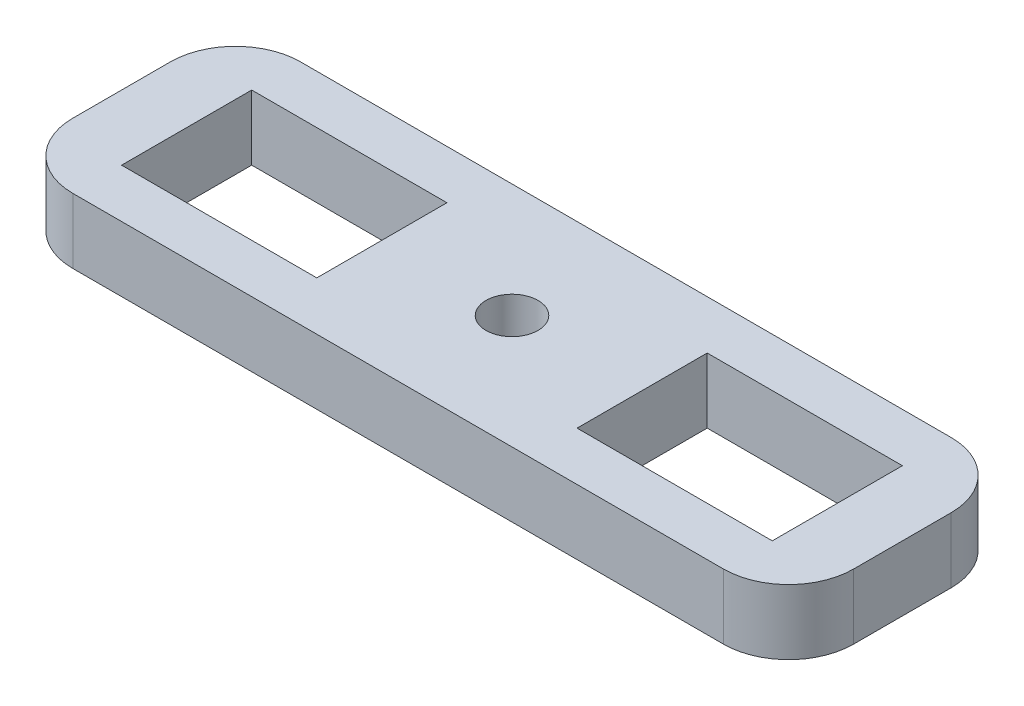
ISO-10303-21;
HEADER;
FILE_DESCRIPTION(('STEP AP214'),'2;1');
FILE_NAME('part.step','',(''),(''),'','','');
FILE_SCHEMA(('AUTOMOTIVE_DESIGN { 1 0 10303 214 1 1 1 1 }'));
ENDSEC;
DATA;
#1=APPLICATION_CONTEXT('core data for automotive mechanical design processes');
#2=APPLICATION_PROTOCOL_DEFINITION('international standard','automotive_design',2000,#1);
#3=PRODUCT_CONTEXT('',#1,'mechanical');
#4=PRODUCT('Part','Part','',(#3));
#5=PRODUCT_RELATED_PRODUCT_CATEGORY('part','',(#4));
#6=PRODUCT_DEFINITION_FORMATION('','',#4);
#7=PRODUCT_DEFINITION_CONTEXT('part definition',#1,'design');
#8=PRODUCT_DEFINITION('design','',#6,#7);
#9=PRODUCT_DEFINITION_SHAPE('','',#8);
#10=(LENGTH_UNIT() NAMED_UNIT(*) SI_UNIT(.MILLI.,.METRE.));
#11=(NAMED_UNIT(*) PLANE_ANGLE_UNIT() SI_UNIT($,.RADIAN.));
#12=(NAMED_UNIT(*) SI_UNIT($,.STERADIAN.) SOLID_ANGLE_UNIT());
#13=UNCERTAINTY_MEASURE_WITH_UNIT(LENGTH_MEASURE(1.E-05),#10,'distance_accuracy_value','');
#14=(GEOMETRIC_REPRESENTATION_CONTEXT(3) GLOBAL_UNCERTAINTY_ASSIGNED_CONTEXT((#13)) GLOBAL_UNIT_ASSIGNED_CONTEXT((#10,
#11,#12)) REPRESENTATION_CONTEXT('',''));
#15=CARTESIAN_POINT('',(0.,0.,0.));
#16=DIRECTION('',(0.,0.,1.));
#17=DIRECTION('',(1.,0.,0.));
#18=AXIS2_PLACEMENT_3D('',#15,#16,#17);
#19=CARTESIAN_POINT('',(10.,10.,-10.));
#20=DIRECTION('',(0.,-1.,0.));
#21=DIRECTION('',(0.,0.,-1.));
#22=AXIS2_PLACEMENT_3D('',#19,#20,#21);
#23=PLANE('',#22);
#24=DIRECTION('',(-1.,0.,0.));
#25=VECTOR('',#24,1.);
#26=CARTESIAN_POINT('',(110.,10.,-27.5));
#27=LINE('',#26,#25);
#28=CARTESIAN_POINT('',(110.,10.,-27.5));
#29=VERTEX_POINT('',#28);
#30=CARTESIAN_POINT('',(80.,10.,-27.5));
#31=VERTEX_POINT('',#30);
#32=EDGE_CURVE('E143',#29,#31,#27,.T.);
#33=ORIENTED_EDGE('',*,*,#32,.F.);
#34=DIRECTION('',(0.,0.,-1.));
#35=VECTOR('',#34,1.);
#36=CARTESIAN_POINT('',(110.,10.,-27.5));
#37=LINE('',#36,#35);
#38=CARTESIAN_POINT('',(110.,10.,-7.5));
#39=VERTEX_POINT('',#38);
#40=EDGE_CURVE('E166',#39,#29,#37,.T.);
#41=ORIENTED_EDGE('',*,*,#40,.F.);
#42=DIRECTION('',(1.,0.,0.));
#43=VECTOR('',#42,1.);
#44=CARTESIAN_POINT('',(110.,10.,-7.5));
#45=LINE('',#44,#43);
#46=CARTESIAN_POINT('',(80.,10.,-7.5));
#47=VERTEX_POINT('',#46);
#48=EDGE_CURVE('E164',#47,#39,#45,.T.);
#49=ORIENTED_EDGE('',*,*,#48,.F.);
#50=DIRECTION('',(0.,0.,1.));
#51=VECTOR('',#50,1.);
#52=CARTESIAN_POINT('',(80.,10.,-27.5));
#53=LINE('',#52,#51);
#54=EDGE_CURVE('E151',#31,#47,#53,.T.);
#55=ORIENTED_EDGE('',*,*,#54,.F.);
#56=EDGE_LOOP('',(#33,#41,#49,#55));
#57=FACE_BOUND('',#56,.T.);
#58=CARTESIAN_POINT('',(10.,10.,-10.));
#59=DIRECTION('',(0.,1.,0.));
#60=DIRECTION('',(0.,0.,-1.));
#61=AXIS2_PLACEMENT_3D('',#58,#59,#60);
#62=CIRCLE('',#61,10.);
#63=CARTESIAN_POINT('',(0.,10.,-10.0000000000001));
#64=VERTEX_POINT('',#63);
#65=CARTESIAN_POINT('',(10.0000000000001,10.,0.));
#66=VERTEX_POINT('',#65);
#67=EDGE_CURVE('E213',#64,#66,#62,.T.);
#68=ORIENTED_EDGE('',*,*,#67,.T.);
#69=DIRECTION('',(1.,0.,0.));
#70=VECTOR('',#69,1.);
#71=CARTESIAN_POINT('',(10.0000000000001,10.,0.));
#72=LINE('',#71,#70);
#73=CARTESIAN_POINT('',(110.,10.,0.));
#74=VERTEX_POINT('',#73);
#75=EDGE_CURVE('E216',#66,#74,#72,.T.);
#76=ORIENTED_EDGE('',*,*,#75,.T.);
#77=CARTESIAN_POINT('',(110.,10.,-10.));
#78=DIRECTION('',(0.,1.,0.));
#79=DIRECTION('',(0.,0.,1.));
#80=AXIS2_PLACEMENT_3D('',#77,#78,#79);
#81=CIRCLE('',#80,10.);
#82=CARTESIAN_POINT('',(120.,10.,-10.0000000000001));
#83=VERTEX_POINT('',#82);
#84=EDGE_CURVE('E219',#74,#83,#81,.T.);
#85=ORIENTED_EDGE('',*,*,#84,.T.);
#86=DIRECTION('',(0.,0.,-1.));
#87=VECTOR('',#86,1.);
#88=CARTESIAN_POINT('',(120.,10.,-10.0000000000001));
#89=LINE('',#88,#87);
#90=CARTESIAN_POINT('',(120.,10.,-24.9999999999999));
#91=VERTEX_POINT('',#90);
#92=EDGE_CURVE('E221',#83,#91,#89,.T.);
#93=ORIENTED_EDGE('',*,*,#92,.T.);
#94=CARTESIAN_POINT('',(110.,10.,-25.));
#95=DIRECTION('',(0.,1.,0.));
#96=DIRECTION('',(0.,0.,-1.));
#97=AXIS2_PLACEMENT_3D('',#94,#95,#96);
#98=CIRCLE('',#97,10.);
#99=CARTESIAN_POINT('',(110.,10.,-35.));
#100=VERTEX_POINT('',#99);
#101=EDGE_CURVE('E223',#91,#100,#98,.T.);
#102=ORIENTED_EDGE('',*,*,#101,.T.);
#103=DIRECTION('',(-1.,0.,0.));
#104=VECTOR('',#103,1.);
#105=CARTESIAN_POINT('',(10.0000000000001,10.,-35.));
#106=LINE('',#105,#104);
#107=CARTESIAN_POINT('',(10.0000000000001,10.,-35.));
#108=VERTEX_POINT('',#107);
#109=EDGE_CURVE('E225',#100,#108,#106,.T.);
#110=ORIENTED_EDGE('',*,*,#109,.T.);
#111=CARTESIAN_POINT('',(10.,10.,-25.));
#112=DIRECTION('',(0.,1.,0.));
#113=DIRECTION('',(0.,0.,-1.));
#114=AXIS2_PLACEMENT_3D('',#111,#112,#113);
#115=CIRCLE('',#114,10.);
#116=CARTESIAN_POINT('',(0.,10.,-24.9999999999999));
#117=VERTEX_POINT('',#116);
#118=EDGE_CURVE('E227',#108,#117,#115,.T.);
#119=ORIENTED_EDGE('',*,*,#118,.T.);
#120=DIRECTION('',(0.,0.,1.));
#121=VECTOR('',#120,1.);
#122=CARTESIAN_POINT('',(0.,10.,-10.0000000000001));
#123=LINE('',#122,#121);
#124=EDGE_CURVE('E229',#117,#64,#123,.T.);
#125=ORIENTED_EDGE('',*,*,#124,.T.);
#126=EDGE_LOOP('',(#68,#76,#85,#93,#102,#110,#119,#125));
#127=FACE_BOUND('',#126,.T.);
#128=DIRECTION('',(0.,0.,-1.));
#129=VECTOR('',#128,1.);
#130=CARTESIAN_POINT('',(40.,10.,-27.5));
#131=LINE('',#130,#129);
#132=CARTESIAN_POINT('',(40.,10.,-7.5));
#133=VERTEX_POINT('',#132);
#134=CARTESIAN_POINT('',(40.,10.,-27.5));
#135=VERTEX_POINT('',#134);
#136=EDGE_CURVE('E182',#133,#135,#131,.T.);
#137=ORIENTED_EDGE('',*,*,#136,.F.);
#138=DIRECTION('',(1.,0.,0.));
#139=VECTOR('',#138,1.);
#140=CARTESIAN_POINT('',(10.,10.,-7.5));
#141=LINE('',#140,#139);
#142=CARTESIAN_POINT('',(10.,10.,-7.5));
#143=VERTEX_POINT('',#142);
#144=EDGE_CURVE('E190',#143,#133,#141,.T.);
#145=ORIENTED_EDGE('',*,*,#144,.F.);
#146=DIRECTION('',(0.,0.,1.));
#147=VECTOR('',#146,1.);
#148=CARTESIAN_POINT('',(10.,10.,-27.5));
#149=LINE('',#148,#147);
#150=CARTESIAN_POINT('',(10.,10.,-27.5));
#151=VERTEX_POINT('',#150);
#152=EDGE_CURVE('E187',#151,#143,#149,.T.);
#153=ORIENTED_EDGE('',*,*,#152,.F.);
#154=DIRECTION('',(-1.,0.,0.));
#155=VECTOR('',#154,1.);
#156=CARTESIAN_POINT('',(10.,10.,-27.5));
#157=LINE('',#156,#155);
#158=EDGE_CURVE('E184',#135,#151,#157,.T.);
#159=ORIENTED_EDGE('',*,*,#158,.F.);
#160=EDGE_LOOP('',(#137,#145,#153,#159));
#161=FACE_BOUND('',#160,.T.);
#162=CARTESIAN_POINT('',(60.,10.,-17.5));
#163=DIRECTION('',(0.,1.,0.));
#164=DIRECTION('',(0.,0.,1.));
#165=AXIS2_PLACEMENT_3D('',#162,#163,#164);
#166=CIRCLE('',#165,4.00000000000001);
#167=CARTESIAN_POINT('',(60.,10.,-13.5));
#168=VERTEX_POINT('',#167);
#169=EDGE_CURVE('E172',#168,#168,#166,.T.);
#170=ORIENTED_EDGE('',*,*,#169,.F.);
#171=EDGE_LOOP('',(#170));
#172=FACE_BOUND('',#171,.T.);
#173=ADVANCED_FACE('F30',(#57,#127,#161,#172),#23,.F.);
#174=CARTESIAN_POINT('',(10.,0.,-10.));
#175=DIRECTION('',(0.,-1.,0.));
#176=DIRECTION('',(0.,0.,-1.));
#177=AXIS2_PLACEMENT_3D('',#174,#175,#176);
#178=PLANE('',#177);
#179=DIRECTION('',(0.,0.,-1.));
#180=VECTOR('',#179,1.);
#181=CARTESIAN_POINT('',(110.,0.,-27.5));
#182=LINE('',#181,#180);
#183=CARTESIAN_POINT('',(110.,0.,-7.5));
#184=VERTEX_POINT('',#183);
#185=CARTESIAN_POINT('',(110.,0.,-27.5));
#186=VERTEX_POINT('',#185);
#187=EDGE_CURVE('E152',#184,#186,#182,.T.);
#188=ORIENTED_EDGE('',*,*,#187,.T.);
#189=DIRECTION('',(-1.,0.,0.));
#190=VECTOR('',#189,1.);
#191=CARTESIAN_POINT('',(110.,0.,-27.5));
#192=LINE('',#191,#190);
#193=CARTESIAN_POINT('',(80.,0.,-27.5));
#194=VERTEX_POINT('',#193);
#195=EDGE_CURVE('E53',#186,#194,#192,.T.);
#196=ORIENTED_EDGE('',*,*,#195,.T.);
#197=DIRECTION('',(0.,0.,1.));
#198=VECTOR('',#197,1.);
#199=CARTESIAN_POINT('',(80.,0.,-27.5));
#200=LINE('',#199,#198);
#201=CARTESIAN_POINT('',(80.,0.,-7.5));
#202=VERTEX_POINT('',#201);
#203=EDGE_CURVE('E158',#194,#202,#200,.T.);
#204=ORIENTED_EDGE('',*,*,#203,.T.);
#205=DIRECTION('',(1.,0.,0.));
#206=VECTOR('',#205,1.);
#207=CARTESIAN_POINT('',(110.,0.,-7.5));
#208=LINE('',#207,#206);
#209=EDGE_CURVE('E174',#202,#184,#208,.T.);
#210=ORIENTED_EDGE('',*,*,#209,.T.);
#211=EDGE_LOOP('',(#188,#196,#204,#210));
#212=FACE_BOUND('',#211,.T.);
#213=CARTESIAN_POINT('',(10.,0.,-10.));
#214=DIRECTION('',(0.,1.,0.));
#215=DIRECTION('',(0.,0.,-1.));
#216=AXIS2_PLACEMENT_3D('',#213,#214,#215);
#217=CIRCLE('',#216,10.);
#218=CARTESIAN_POINT('',(0.,0.,-10.0000000000001));
#219=VERTEX_POINT('',#218);
#220=CARTESIAN_POINT('',(10.0000000000001,0.,0.));
#221=VERTEX_POINT('',#220);
#222=EDGE_CURVE('E212',#219,#221,#217,.T.);
#223=ORIENTED_EDGE('',*,*,#222,.F.);
#224=DIRECTION('',(0.,0.,1.));
#225=VECTOR('',#224,1.);
#226=CARTESIAN_POINT('',(0.,0.,-10.0000000000001));
#227=LINE('',#226,#225);
#228=CARTESIAN_POINT('',(0.,0.,-24.9999999999999));
#229=VERTEX_POINT('',#228);
#230=EDGE_CURVE('E217',#229,#219,#227,.T.);
#231=ORIENTED_EDGE('',*,*,#230,.F.);
#232=CARTESIAN_POINT('',(10.,0.,-25.));
#233=DIRECTION('',(0.,1.,0.));
#234=DIRECTION('',(0.,0.,-1.));
#235=AXIS2_PLACEMENT_3D('',#232,#233,#234);
#236=CIRCLE('',#235,10.);
#237=CARTESIAN_POINT('',(10.0000000000001,0.,-35.));
#238=VERTEX_POINT('',#237);
#239=EDGE_CURVE('E244',#238,#229,#236,.T.);
#240=ORIENTED_EDGE('',*,*,#239,.F.);
#241=DIRECTION('',(-1.,0.,0.));
#242=VECTOR('',#241,1.);
#243=CARTESIAN_POINT('',(10.0000000000001,0.,-35.));
#244=LINE('',#243,#242);
#245=CARTESIAN_POINT('',(110.,0.,-35.));
#246=VERTEX_POINT('',#245);
#247=EDGE_CURVE('E242',#246,#238,#244,.T.);
#248=ORIENTED_EDGE('',*,*,#247,.F.);
#249=CARTESIAN_POINT('',(110.,0.,-25.));
#250=DIRECTION('',(0.,1.,0.));
#251=DIRECTION('',(0.,0.,-1.));
#252=AXIS2_PLACEMENT_3D('',#249,#250,#251);
#253=CIRCLE('',#252,10.);
#254=CARTESIAN_POINT('',(120.,0.,-24.9999999999999));
#255=VERTEX_POINT('',#254);
#256=EDGE_CURVE('E240',#255,#246,#253,.T.);
#257=ORIENTED_EDGE('',*,*,#256,.F.);
#258=DIRECTION('',(0.,0.,-1.));
#259=VECTOR('',#258,1.);
#260=CARTESIAN_POINT('',(120.,0.,-10.0000000000001));
#261=LINE('',#260,#259);
#262=CARTESIAN_POINT('',(120.,0.,-10.0000000000001));
#263=VERTEX_POINT('',#262);
#264=EDGE_CURVE('E238',#263,#255,#261,.T.);
#265=ORIENTED_EDGE('',*,*,#264,.F.);
#266=CARTESIAN_POINT('',(110.,0.,-10.));
#267=DIRECTION('',(0.,1.,0.));
#268=DIRECTION('',(0.,0.,1.));
#269=AXIS2_PLACEMENT_3D('',#266,#267,#268);
#270=CIRCLE('',#269,10.);
#271=CARTESIAN_POINT('',(110.,0.,0.));
#272=VERTEX_POINT('',#271);
#273=EDGE_CURVE('E236',#272,#263,#270,.T.);
#274=ORIENTED_EDGE('',*,*,#273,.F.);
#275=DIRECTION('',(1.,0.,0.));
#276=VECTOR('',#275,1.);
#277=CARTESIAN_POINT('',(10.0000000000001,0.,0.));
#278=LINE('',#277,#276);
#279=EDGE_CURVE('E234',#221,#272,#278,.T.);
#280=ORIENTED_EDGE('',*,*,#279,.F.);
#281=EDGE_LOOP('',(#223,#231,#240,#248,#257,#265,#274,#280));
#282=FACE_BOUND('',#281,.T.);
#283=DIRECTION('',(1.,0.,0.));
#284=VECTOR('',#283,1.);
#285=CARTESIAN_POINT('',(10.,0.,-7.5));
#286=LINE('',#285,#284);
#287=CARTESIAN_POINT('',(10.,0.,-7.5));
#288=VERTEX_POINT('',#287);
#289=CARTESIAN_POINT('',(40.,0.,-7.5));
#290=VERTEX_POINT('',#289);
#291=EDGE_CURVE('E185',#288,#290,#286,.T.);
#292=ORIENTED_EDGE('',*,*,#291,.T.);
#293=DIRECTION('',(0.,0.,-1.));
#294=VECTOR('',#293,1.);
#295=CARTESIAN_POINT('',(40.,0.,-27.5));
#296=LINE('',#295,#294);
#297=CARTESIAN_POINT('',(40.,0.,-27.5));
#298=VERTEX_POINT('',#297);
#299=EDGE_CURVE('E159',#290,#298,#296,.T.);
#300=ORIENTED_EDGE('',*,*,#299,.T.);
#301=DIRECTION('',(-1.,0.,0.));
#302=VECTOR('',#301,1.);
#303=CARTESIAN_POINT('',(10.,0.,-27.5));
#304=LINE('',#303,#302);
#305=CARTESIAN_POINT('',(10.,0.,-27.5));
#306=VERTEX_POINT('',#305);
#307=EDGE_CURVE('E195',#298,#306,#304,.T.);
#308=ORIENTED_EDGE('',*,*,#307,.T.);
#309=DIRECTION('',(0.,0.,1.));
#310=VECTOR('',#309,1.);
#311=CARTESIAN_POINT('',(10.,0.,-27.5));
#312=LINE('',#311,#310);
#313=EDGE_CURVE('E198',#306,#288,#312,.T.);
#314=ORIENTED_EDGE('',*,*,#313,.T.);
#315=EDGE_LOOP('',(#292,#300,#308,#314));
#316=FACE_BOUND('',#315,.T.);
#317=CARTESIAN_POINT('',(60.,0.,-17.5));
#318=DIRECTION('',(0.,1.,0.));
#319=DIRECTION('',(0.,0.,1.));
#320=AXIS2_PLACEMENT_3D('',#317,#318,#319);
#321=CIRCLE('',#320,4.00000000000001);
#322=CARTESIAN_POINT('',(60.,0.,-13.5));
#323=VERTEX_POINT('',#322);
#324=EDGE_CURVE('E352',#323,#323,#321,.T.);
#325=ORIENTED_EDGE('',*,*,#324,.T.);
#326=EDGE_LOOP('',(#325));
#327=FACE_BOUND('',#326,.T.);
#328=ADVANCED_FACE('F274',(#212,#282,#316,#327),#178,.T.);
#329=CARTESIAN_POINT('',(10.,10.,-10.));
#330=DIRECTION('',(0.,-1.,0.));
#331=DIRECTION('',(0.,0.,-1.));
#332=AXIS2_PLACEMENT_3D('',#329,#330,#331);
#333=CYLINDRICAL_SURFACE('',#332,10.);
#334=ORIENTED_EDGE('',*,*,#222,.T.);
#335=DIRECTION('',(0.,-1.,0.));
#336=VECTOR('',#335,1.);
#337=CARTESIAN_POINT('',(10.0000000000001,10.,0.));
#338=LINE('',#337,#336);
#339=EDGE_CURVE('E11',#66,#221,#338,.T.);
#340=ORIENTED_EDGE('',*,*,#339,.F.);
#341=ORIENTED_EDGE('',*,*,#67,.F.);
#342=DIRECTION('',(0.,-1.,0.));
#343=VECTOR('',#342,1.);
#344=CARTESIAN_POINT('',(0.,10.,-10.0000000000001));
#345=LINE('',#344,#343);
#346=EDGE_CURVE('E231',#64,#219,#345,.T.);
#347=ORIENTED_EDGE('',*,*,#346,.T.);
#348=EDGE_LOOP('',(#334,#340,#341,#347));
#349=FACE_BOUND('',#348,.T.);
#350=ADVANCED_FACE('F32',(#349),#333,.T.);
#351=CARTESIAN_POINT('',(10.0000000000001,10.,0.));
#352=DIRECTION('',(0.,0.,-1.));
#353=DIRECTION('',(-1.,0.,0.));
#354=AXIS2_PLACEMENT_3D('',#351,#352,#353);
#355=PLANE('',#354);
#356=ORIENTED_EDGE('',*,*,#279,.T.);
#357=DIRECTION('',(0.,-1.,0.));
#358=VECTOR('',#357,1.);
#359=CARTESIAN_POINT('',(110.,10.,0.));
#360=LINE('',#359,#358);
#361=EDGE_CURVE('E38',#74,#272,#360,.T.);
#362=ORIENTED_EDGE('',*,*,#361,.F.);
#363=ORIENTED_EDGE('',*,*,#75,.F.);
#364=ORIENTED_EDGE('',*,*,#339,.T.);
#365=EDGE_LOOP('',(#356,#362,#363,#364));
#366=FACE_BOUND('',#365,.T.);
#367=ADVANCED_FACE('F291',(#366),#355,.F.);
#368=CARTESIAN_POINT('',(110.,10.,-10.));
#369=DIRECTION('',(0.,-1.,0.));
#370=DIRECTION('',(0.,0.,-1.));
#371=AXIS2_PLACEMENT_3D('',#368,#369,#370);
#372=CYLINDRICAL_SURFACE('',#371,10.);
#373=ORIENTED_EDGE('',*,*,#273,.T.);
#374=DIRECTION('',(0.,-1.,0.));
#375=VECTOR('',#374,1.);
#376=CARTESIAN_POINT('',(120.,10.,-10.0000000000001));
#377=LINE('',#376,#375);
#378=EDGE_CURVE('E261',#83,#263,#377,.T.);
#379=ORIENTED_EDGE('',*,*,#378,.F.);
#380=ORIENTED_EDGE('',*,*,#84,.F.);
#381=ORIENTED_EDGE('',*,*,#361,.T.);
#382=EDGE_LOOP('',(#373,#379,#380,#381));
#383=FACE_BOUND('',#382,.T.);
#384=ADVANCED_FACE('F268',(#383),#372,.T.);
#385=CARTESIAN_POINT('',(120.,10.,-10.0000000000001));
#386=DIRECTION('',(-1.,0.,0.));
#387=DIRECTION('',(0.,0.,1.));
#388=AXIS2_PLACEMENT_3D('',#385,#386,#387);
#389=PLANE('',#388);
#390=ORIENTED_EDGE('',*,*,#264,.T.);
#391=DIRECTION('',(0.,-1.,0.));
#392=VECTOR('',#391,1.);
#393=CARTESIAN_POINT('',(120.,10.,-24.9999999999999));
#394=LINE('',#393,#392);
#395=EDGE_CURVE('E258',#91,#255,#394,.T.);
#396=ORIENTED_EDGE('',*,*,#395,.F.);
#397=ORIENTED_EDGE('',*,*,#92,.F.);
#398=ORIENTED_EDGE('',*,*,#378,.T.);
#399=EDGE_LOOP('',(#390,#396,#397,#398));
#400=FACE_BOUND('',#399,.T.);
#401=ADVANCED_FACE('F280',(#400),#389,.F.);
#402=CARTESIAN_POINT('',(110.,10.,-25.));
#403=DIRECTION('',(0.,-1.,0.));
#404=DIRECTION('',(0.,0.,-1.));
#405=AXIS2_PLACEMENT_3D('',#402,#403,#404);
#406=CYLINDRICAL_SURFACE('',#405,10.);
#407=ORIENTED_EDGE('',*,*,#256,.T.);
#408=DIRECTION('',(0.,-1.,0.));
#409=VECTOR('',#408,1.);
#410=CARTESIAN_POINT('',(110.,10.,-35.));
#411=LINE('',#410,#409);
#412=EDGE_CURVE('E255',#100,#246,#411,.T.);
#413=ORIENTED_EDGE('',*,*,#412,.F.);
#414=ORIENTED_EDGE('',*,*,#101,.F.);
#415=ORIENTED_EDGE('',*,*,#395,.T.);
#416=EDGE_LOOP('',(#407,#413,#414,#415));
#417=FACE_BOUND('',#416,.T.);
#418=ADVANCED_FACE('F284',(#417),#406,.T.);
#419=CARTESIAN_POINT('',(10.0000000000001,10.,-35.));
#420=DIRECTION('',(0.,0.,1.));
#421=DIRECTION('',(1.,0.,0.));
#422=AXIS2_PLACEMENT_3D('',#419,#420,#421);
#423=PLANE('',#422);
#424=ORIENTED_EDGE('',*,*,#247,.T.);
#425=DIRECTION('',(0.,-1.,0.));
#426=VECTOR('',#425,1.);
#427=CARTESIAN_POINT('',(10.0000000000001,10.,-35.));
#428=LINE('',#427,#426);
#429=EDGE_CURVE('E252',#108,#238,#428,.T.);
#430=ORIENTED_EDGE('',*,*,#429,.F.);
#431=ORIENTED_EDGE('',*,*,#109,.F.);
#432=ORIENTED_EDGE('',*,*,#412,.T.);
#433=EDGE_LOOP('',(#424,#430,#431,#432));
#434=FACE_BOUND('',#433,.T.);
#435=ADVANCED_FACE('F304',(#434),#423,.F.);
#436=CARTESIAN_POINT('',(10.,10.,-25.));
#437=DIRECTION('',(0.,-1.,0.));
#438=DIRECTION('',(0.,0.,-1.));
#439=AXIS2_PLACEMENT_3D('',#436,#437,#438);
#440=CYLINDRICAL_SURFACE('',#439,10.);
#441=ORIENTED_EDGE('',*,*,#239,.T.);
#442=DIRECTION('',(0.,-1.,0.));
#443=VECTOR('',#442,1.);
#444=CARTESIAN_POINT('',(0.,10.,-24.9999999999999));
#445=LINE('',#444,#443);
#446=EDGE_CURVE('E249',#117,#229,#445,.T.);
#447=ORIENTED_EDGE('',*,*,#446,.F.);
#448=ORIENTED_EDGE('',*,*,#118,.F.);
#449=ORIENTED_EDGE('',*,*,#429,.T.);
#450=EDGE_LOOP('',(#441,#447,#448,#449));
#451=FACE_BOUND('',#450,.T.);
#452=ADVANCED_FACE('F302',(#451),#440,.T.);
#453=CARTESIAN_POINT('',(0.,10.,-10.0000000000001));
#454=DIRECTION('',(1.,0.,0.));
#455=DIRECTION('',(0.,0.,-1.));
#456=AXIS2_PLACEMENT_3D('',#453,#454,#455);
#457=PLANE('',#456);
#458=ORIENTED_EDGE('',*,*,#230,.T.);
#459=ORIENTED_EDGE('',*,*,#346,.F.);
#460=ORIENTED_EDGE('',*,*,#124,.F.);
#461=ORIENTED_EDGE('',*,*,#446,.T.);
#462=EDGE_LOOP('',(#458,#459,#460,#461));
#463=FACE_BOUND('',#462,.T.);
#464=ADVANCED_FACE('F297',(#463),#457,.F.);
#465=CARTESIAN_POINT('',(40.,10.,-27.5));
#466=DIRECTION('',(-1.,0.,0.));
#467=DIRECTION('',(0.,0.,1.));
#468=AXIS2_PLACEMENT_3D('',#465,#466,#467);
#469=PLANE('',#468);
#470=ORIENTED_EDGE('',*,*,#299,.F.);
#471=DIRECTION('',(0.,-1.,0.));
#472=VECTOR('',#471,1.);
#473=CARTESIAN_POINT('',(40.,10.,-7.5));
#474=LINE('',#473,#472);
#475=EDGE_CURVE('E192',#133,#290,#474,.T.);
#476=ORIENTED_EDGE('',*,*,#475,.F.);
#477=ORIENTED_EDGE('',*,*,#136,.T.);
#478=DIRECTION('',(0.,-1.,0.));
#479=VECTOR('',#478,1.);
#480=CARTESIAN_POINT('',(40.,10.,-27.5));
#481=LINE('',#480,#479);
#482=EDGE_CURVE('E209',#135,#298,#481,.T.);
#483=ORIENTED_EDGE('',*,*,#482,.T.);
#484=EDGE_LOOP('',(#470,#476,#477,#483));
#485=FACE_BOUND('',#484,.T.);
#486=ADVANCED_FACE('F321',(#485),#469,.T.);
#487=CARTESIAN_POINT('',(10.,10.,-27.5));
#488=DIRECTION('',(0.,0.,1.));
#489=DIRECTION('',(1.,0.,0.));
#490=AXIS2_PLACEMENT_3D('',#487,#488,#489);
#491=PLANE('',#490);
#492=ORIENTED_EDGE('',*,*,#307,.F.);
#493=ORIENTED_EDGE('',*,*,#482,.F.);
#494=ORIENTED_EDGE('',*,*,#158,.T.);
#495=DIRECTION('',(0.,-1.,0.));
#496=VECTOR('',#495,1.);
#497=CARTESIAN_POINT('',(10.,10.,-27.5));
#498=LINE('',#497,#496);
#499=EDGE_CURVE('E207',#151,#306,#498,.T.);
#500=ORIENTED_EDGE('',*,*,#499,.T.);
#501=EDGE_LOOP('',(#492,#493,#494,#500));
#502=FACE_BOUND('',#501,.T.);
#503=ADVANCED_FACE('F328',(#502),#491,.T.);
#504=CARTESIAN_POINT('',(10.,10.,-27.5));
#505=DIRECTION('',(1.,0.,0.));
#506=DIRECTION('',(0.,0.,-1.));
#507=AXIS2_PLACEMENT_3D('',#504,#505,#506);
#508=PLANE('',#507);
#509=ORIENTED_EDGE('',*,*,#313,.F.);
#510=ORIENTED_EDGE('',*,*,#499,.F.);
#511=ORIENTED_EDGE('',*,*,#152,.T.);
#512=DIRECTION('',(0.,-1.,0.));
#513=VECTOR('',#512,1.);
#514=CARTESIAN_POINT('',(10.,10.,-7.5));
#515=LINE('',#514,#513);
#516=EDGE_CURVE('E205',#143,#288,#515,.T.);
#517=ORIENTED_EDGE('',*,*,#516,.T.);
#518=EDGE_LOOP('',(#509,#510,#511,#517));
#519=FACE_BOUND('',#518,.T.);
#520=ADVANCED_FACE('F333',(#519),#508,.T.);
#521=CARTESIAN_POINT('',(10.,10.,-7.5));
#522=DIRECTION('',(0.,0.,-1.));
#523=DIRECTION('',(-1.,0.,0.));
#524=AXIS2_PLACEMENT_3D('',#521,#522,#523);
#525=PLANE('',#524);
#526=ORIENTED_EDGE('',*,*,#291,.F.);
#527=ORIENTED_EDGE('',*,*,#516,.F.);
#528=ORIENTED_EDGE('',*,*,#144,.T.);
#529=ORIENTED_EDGE('',*,*,#475,.T.);
#530=EDGE_LOOP('',(#526,#527,#528,#529));
#531=FACE_BOUND('',#530,.T.);
#532=ADVANCED_FACE('F340',(#531),#525,.T.);
#533=CARTESIAN_POINT('',(110.,10.,-27.5));
#534=DIRECTION('',(0.,0.,1.));
#535=DIRECTION('',(1.,0.,0.));
#536=AXIS2_PLACEMENT_3D('',#533,#534,#535);
#537=PLANE('',#536);
#538=ORIENTED_EDGE('',*,*,#195,.F.);
#539=DIRECTION('',(0.,-1.,0.));
#540=VECTOR('',#539,1.);
#541=CARTESIAN_POINT('',(110.,10.,-27.5));
#542=LINE('',#541,#540);
#543=EDGE_CURVE('E147',#29,#186,#542,.T.);
#544=ORIENTED_EDGE('',*,*,#543,.F.);
#545=ORIENTED_EDGE('',*,*,#32,.T.);
#546=DIRECTION('',(0.,-1.,0.));
#547=VECTOR('',#546,1.);
#548=CARTESIAN_POINT('',(80.,10.,-27.5));
#549=LINE('',#548,#547);
#550=EDGE_CURVE('E146',#31,#194,#549,.T.);
#551=ORIENTED_EDGE('',*,*,#550,.T.);
#552=EDGE_LOOP('',(#538,#544,#545,#551));
#553=FACE_BOUND('',#552,.T.);
#554=ADVANCED_FACE('F145',(#553),#537,.T.);
#555=CARTESIAN_POINT('',(80.,10.,-27.5));
#556=DIRECTION('',(1.,0.,0.));
#557=DIRECTION('',(0.,0.,-1.));
#558=AXIS2_PLACEMENT_3D('',#555,#556,#557);
#559=PLANE('',#558);
#560=ORIENTED_EDGE('',*,*,#203,.F.);
#561=ORIENTED_EDGE('',*,*,#550,.F.);
#562=ORIENTED_EDGE('',*,*,#54,.T.);
#563=DIRECTION('',(0.,-1.,0.));
#564=VECTOR('',#563,1.);
#565=CARTESIAN_POINT('',(80.,10.,-7.5));
#566=LINE('',#565,#564);
#567=EDGE_CURVE('E160',#47,#202,#566,.T.);
#568=ORIENTED_EDGE('',*,*,#567,.T.);
#569=EDGE_LOOP('',(#560,#561,#562,#568));
#570=FACE_BOUND('',#569,.T.);
#571=ADVANCED_FACE('F155',(#570),#559,.T.);
#572=CARTESIAN_POINT('',(110.,10.,-7.5));
#573=DIRECTION('',(0.,0.,-1.));
#574=DIRECTION('',(-1.,0.,0.));
#575=AXIS2_PLACEMENT_3D('',#572,#573,#574);
#576=PLANE('',#575);
#577=ORIENTED_EDGE('',*,*,#209,.F.);
#578=ORIENTED_EDGE('',*,*,#567,.F.);
#579=ORIENTED_EDGE('',*,*,#48,.T.);
#580=DIRECTION('',(0.,-1.,0.));
#581=VECTOR('',#580,1.);
#582=CARTESIAN_POINT('',(110.,10.,-7.5));
#583=LINE('',#582,#581);
#584=EDGE_CURVE('E45',#39,#184,#583,.T.);
#585=ORIENTED_EDGE('',*,*,#584,.T.);
#586=EDGE_LOOP('',(#577,#578,#579,#585));
#587=FACE_BOUND('',#586,.T.);
#588=ADVANCED_FACE('F364',(#587),#576,.T.);
#589=CARTESIAN_POINT('',(110.,10.,-27.5));
#590=DIRECTION('',(-1.,0.,0.));
#591=DIRECTION('',(0.,0.,1.));
#592=AXIS2_PLACEMENT_3D('',#589,#590,#591);
#593=PLANE('',#592);
#594=ORIENTED_EDGE('',*,*,#187,.F.);
#595=ORIENTED_EDGE('',*,*,#584,.F.);
#596=ORIENTED_EDGE('',*,*,#40,.T.);
#597=ORIENTED_EDGE('',*,*,#543,.T.);
#598=EDGE_LOOP('',(#594,#595,#596,#597));
#599=FACE_BOUND('',#598,.T.);
#600=ADVANCED_FACE('F359',(#599),#593,.T.);
#601=CARTESIAN_POINT('',(60.,10.,-17.5));
#602=DIRECTION('',(0.,-1.,0.));
#603=DIRECTION('',(0.,0.,-1.));
#604=AXIS2_PLACEMENT_3D('',#601,#602,#603);
#605=CYLINDRICAL_SURFACE('',#604,4.00000000000001);
#606=ORIENTED_EDGE('',*,*,#169,.T.);
#607=EDGE_LOOP('',(#606));
#608=FACE_BOUND('',#607,.T.);
#609=ORIENTED_EDGE('',*,*,#324,.F.);
#610=EDGE_LOOP('',(#609));
#611=FACE_BOUND('',#610,.T.);
#612=ADVANCED_FACE('F357',(#608,#611),#605,.F.);
#613=CLOSED_SHELL('',(#173,#328,#350,#367,#384,#401,#418,#435,#452,#464,#486,#503,#520,#532,
#554,#571,#588,#600,#612));
#614=MANIFOLD_SOLID_BREP('B2',#613);
#615=ADVANCED_BREP_SHAPE_REPRESENTATION('',(#18,#614),#14);
#616=SHAPE_DEFINITION_REPRESENTATION(#9,#615);
ENDSEC;
END-ISO-10303-21;
